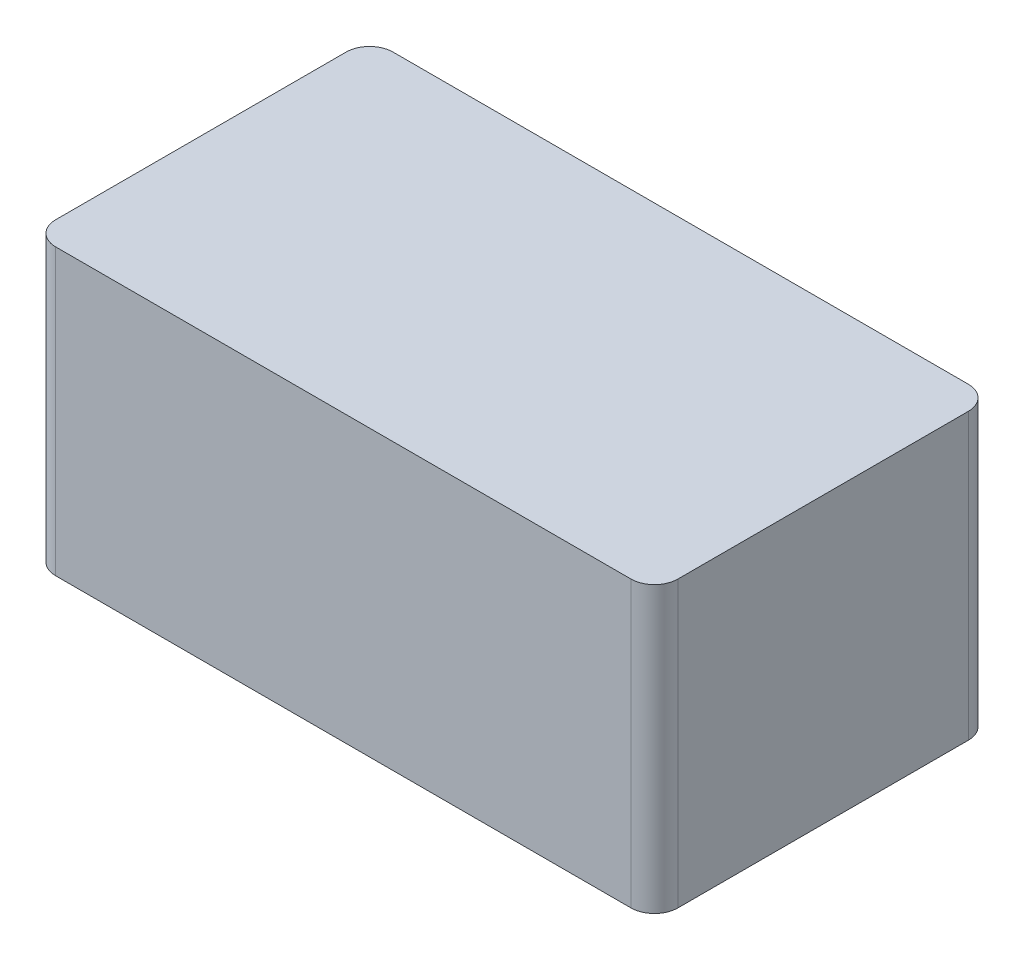
ISO-10303-21;
HEADER;
FILE_DESCRIPTION(('STEP AP214'),'2;1');
FILE_NAME('part.step','',(''),(''),'','','');
FILE_SCHEMA(('AUTOMOTIVE_DESIGN { 1 0 10303 214 1 1 1 1 }'));
ENDSEC;
DATA;
#1=APPLICATION_CONTEXT('core data for automotive mechanical design processes');
#2=APPLICATION_PROTOCOL_DEFINITION('international standard','automotive_design',2000,#1);
#3=PRODUCT_CONTEXT('',#1,'mechanical');
#4=PRODUCT('Part','Part','',(#3));
#5=PRODUCT_RELATED_PRODUCT_CATEGORY('part','',(#4));
#6=PRODUCT_DEFINITION_FORMATION('','',#4);
#7=PRODUCT_DEFINITION_CONTEXT('part definition',#1,'design');
#8=PRODUCT_DEFINITION('design','',#6,#7);
#9=PRODUCT_DEFINITION_SHAPE('','',#8);
#10=(LENGTH_UNIT() NAMED_UNIT(*) SI_UNIT(.MILLI.,.METRE.));
#11=(NAMED_UNIT(*) PLANE_ANGLE_UNIT() SI_UNIT($,.RADIAN.));
#12=(NAMED_UNIT(*) SI_UNIT($,.STERADIAN.) SOLID_ANGLE_UNIT());
#13=UNCERTAINTY_MEASURE_WITH_UNIT(LENGTH_MEASURE(1.E-05),#10,'distance_accuracy_value','');
#14=(GEOMETRIC_REPRESENTATION_CONTEXT(3) GLOBAL_UNCERTAINTY_ASSIGNED_CONTEXT((#13)) GLOBAL_UNIT_ASSIGNED_CONTEXT((#10,
#11,#12)) REPRESENTATION_CONTEXT('',''));
#15=CARTESIAN_POINT('',(0.,0.,0.));
#16=DIRECTION('',(0.,0.,1.));
#17=DIRECTION('',(1.,0.,0.));
#18=AXIS2_PLACEMENT_3D('',#15,#16,#17);
#19=CARTESIAN_POINT('',(-10.4,-5.150000001,-5.25));
#20=DIRECTION('',(0.,1.,0.));
#21=DIRECTION('',(0.,0.,1.));
#22=AXIS2_PLACEMENT_3D('',#19,#20,#21);
#23=CYLINDRICAL_SURFACE('',#22,0.849999999999999);
#24=CARTESIAN_POINT('',(-10.4,-5.150000001,-5.25));
#25=DIRECTION('',(0.,1.,0.));
#26=DIRECTION('',(0.,0.,1.));
#27=AXIS2_PLACEMENT_3D('',#24,#25,#26);
#28=CIRCLE('',#27,0.849999999999999);
#29=CARTESIAN_POINT('',(-10.4,-5.150000001,-6.1));
#30=VERTEX_POINT('',#29);
#31=CARTESIAN_POINT('',(-11.25,-5.1500000005,-5.24999964644661));
#32=VERTEX_POINT('',#31);
#33=EDGE_CURVE('E123',#30,#32,#28,.T.);
#34=ORIENTED_EDGE('',*,*,#33,.T.);
#35=DIRECTION('',(0.,1.,0.));
#36=VECTOR('',#35,1.);
#37=CARTESIAN_POINT('',(-11.25,0.,-5.25));
#38=LINE('',#37,#36);
#39=CARTESIAN_POINT('',(-11.25,5.15,-5.25));
#40=VERTEX_POINT('',#39);
#41=EDGE_CURVE('E130',#32,#40,#38,.T.);
#42=ORIENTED_EDGE('',*,*,#41,.T.);
#43=CARTESIAN_POINT('',(-10.4,5.15,-5.25));
#44=DIRECTION('',(0.,1.,0.));
#45=DIRECTION('',(0.,0.,1.));
#46=AXIS2_PLACEMENT_3D('',#43,#44,#45);
#47=CIRCLE('',#46,0.849999999999999);
#48=CARTESIAN_POINT('',(-10.4,5.15,-6.1));
#49=VERTEX_POINT('',#48);
#50=EDGE_CURVE('E66',#40,#49,#47,.F.);
#51=ORIENTED_EDGE('',*,*,#50,.T.);
#52=DIRECTION('',(0.,1.,0.));
#53=VECTOR('',#52,1.);
#54=CARTESIAN_POINT('',(-10.4,-5.150000001,-6.1));
#55=LINE('',#54,#53);
#56=EDGE_CURVE('E127',#30,#49,#55,.T.);
#57=ORIENTED_EDGE('',*,*,#56,.F.);
#58=EDGE_LOOP('',(#34,#42,#51,#57));
#59=FACE_BOUND('',#58,.T.);
#60=ADVANCED_FACE('F17',(#59),#23,.T.);
#61=CARTESIAN_POINT('',(11.25,0.,0.));
#62=DIRECTION('',(-1.,0.,0.));
#63=DIRECTION('',(0.,0.,1.));
#64=AXIS2_PLACEMENT_3D('',#61,#62,#63);
#65=PLANE('',#64);
#66=DIRECTION('',(0.,-1.,0.));
#67=VECTOR('',#66,1.);
#68=CARTESIAN_POINT('',(11.25,-5.00000214842533E-10,5.25));
#69=LINE('',#68,#67);
#70=CARTESIAN_POINT('',(11.25,5.15,5.25));
#71=VERTEX_POINT('',#70);
#72=CARTESIAN_POINT('',(11.25,-5.1500000005,5.25));
#73=VERTEX_POINT('',#72);
#74=EDGE_CURVE('E126',#71,#73,#69,.T.);
#75=ORIENTED_EDGE('',*,*,#74,.T.);
#76=DIRECTION('',(0.,0.,-1.));
#77=VECTOR('',#76,1.);
#78=CARTESIAN_POINT('',(11.25,-5.15,0.));
#79=LINE('',#78,#77);
#80=CARTESIAN_POINT('',(11.25,-5.1500000005,-5.25));
#81=VERTEX_POINT('',#80);
#82=EDGE_CURVE('E92',#73,#81,#79,.T.);
#83=ORIENTED_EDGE('',*,*,#82,.T.);
#84=DIRECTION('',(0.,1.,0.));
#85=VECTOR('',#84,1.);
#86=CARTESIAN_POINT('',(11.25,0.,-5.25));
#87=LINE('',#86,#85);
#88=CARTESIAN_POINT('',(11.25,5.15,-5.25));
#89=VERTEX_POINT('',#88);
#90=EDGE_CURVE('E85',#89,#81,#87,.F.);
#91=ORIENTED_EDGE('',*,*,#90,.F.);
#92=DIRECTION('',(0.,0.,-1.));
#93=VECTOR('',#92,1.);
#94=CARTESIAN_POINT('',(11.25,5.15,0.));
#95=LINE('',#94,#93);
#96=EDGE_CURVE('E89',#89,#71,#95,.F.);
#97=ORIENTED_EDGE('',*,*,#96,.T.);
#98=EDGE_LOOP('',(#75,#83,#91,#97));
#99=FACE_BOUND('',#98,.T.);
#100=ADVANCED_FACE('F87',(#99),#65,.F.);
#101=CARTESIAN_POINT('',(10.4,-5.150000001,-5.25));
#102=DIRECTION('',(0.,1.,0.));
#103=DIRECTION('',(0.,0.,1.));
#104=AXIS2_PLACEMENT_3D('',#101,#102,#103);
#105=CYLINDRICAL_SURFACE('',#104,0.849999999999998);
#106=DIRECTION('',(0.,1.,0.));
#107=VECTOR('',#106,1.);
#108=CARTESIAN_POINT('',(10.4,0.,-6.1));
#109=LINE('',#108,#107);
#110=CARTESIAN_POINT('',(10.4,-5.15000000025,-6.1));
#111=VERTEX_POINT('',#110);
#112=CARTESIAN_POINT('',(10.4,5.15,-6.1));
#113=VERTEX_POINT('',#112);
#114=EDGE_CURVE('E97',#111,#113,#109,.T.);
#115=ORIENTED_EDGE('',*,*,#114,.T.);
#116=CARTESIAN_POINT('',(10.4,5.15,-5.25));
#117=DIRECTION('',(0.,1.,0.));
#118=DIRECTION('',(0.,0.,1.));
#119=AXIS2_PLACEMENT_3D('',#116,#117,#118);
#120=CIRCLE('',#119,0.849999999999998);
#121=EDGE_CURVE('E96',#89,#113,#120,.T.);
#122=ORIENTED_EDGE('',*,*,#121,.F.);
#123=ORIENTED_EDGE('',*,*,#90,.T.);
#124=CARTESIAN_POINT('',(10.4,-5.1500000005,-5.25));
#125=DIRECTION('',(0.,1.,0.));
#126=DIRECTION('',(0.,0.,1.));
#127=AXIS2_PLACEMENT_3D('',#124,#125,#126);
#128=CIRCLE('',#127,0.849999999999998);
#129=EDGE_CURVE('E121',#81,#111,#128,.T.);
#130=ORIENTED_EDGE('',*,*,#129,.T.);
#131=EDGE_LOOP('',(#115,#122,#123,#130));
#132=FACE_BOUND('',#131,.T.);
#133=ADVANCED_FACE('F100',(#132),#105,.T.);
#134=CARTESIAN_POINT('',(0.,5.15,0.));
#135=DIRECTION('',(0.,-1.,0.));
#136=DIRECTION('',(0.,0.,-1.));
#137=AXIS2_PLACEMENT_3D('',#134,#135,#136);
#138=PLANE('',#137);
#139=DIRECTION('',(-1.,0.,0.));
#140=VECTOR('',#139,1.);
#141=CARTESIAN_POINT('',(0.,5.15,6.1));
#142=LINE('',#141,#140);
#143=CARTESIAN_POINT('',(10.4,5.14999983333333,6.1));
#144=VERTEX_POINT('',#143);
#145=CARTESIAN_POINT('',(-10.4,5.15,6.1));
#146=VERTEX_POINT('',#145);
#147=EDGE_CURVE('E135',#144,#146,#142,.T.);
#148=ORIENTED_EDGE('',*,*,#147,.F.);
#149=CARTESIAN_POINT('',(10.4,5.15,5.25));
#150=DIRECTION('',(0.,1.,0.));
#151=DIRECTION('',(0.,0.,1.));
#152=AXIS2_PLACEMENT_3D('',#149,#150,#151);
#153=CIRCLE('',#152,0.849999999999999);
#154=EDGE_CURVE('E106',#144,#71,#153,.T.);
#155=ORIENTED_EDGE('',*,*,#154,.T.);
#156=ORIENTED_EDGE('',*,*,#96,.F.);
#157=ORIENTED_EDGE('',*,*,#121,.T.);
#158=DIRECTION('',(1.,0.,0.));
#159=VECTOR('',#158,1.);
#160=CARTESIAN_POINT('',(0.,5.15,-6.1));
#161=LINE('',#160,#159);
#162=EDGE_CURVE('E108',#49,#113,#161,.T.);
#163=ORIENTED_EDGE('',*,*,#162,.F.);
#164=ORIENTED_EDGE('',*,*,#50,.F.);
#165=DIRECTION('',(0.,0.,-1.));
#166=VECTOR('',#165,1.);
#167=CARTESIAN_POINT('',(-11.25,5.15,0.));
#168=LINE('',#167,#166);
#169=CARTESIAN_POINT('',(-11.25,5.15,5.25));
#170=VERTEX_POINT('',#169);
#171=EDGE_CURVE('E72',#40,#170,#168,.F.);
#172=ORIENTED_EDGE('',*,*,#171,.T.);
#173=CARTESIAN_POINT('',(-10.4,5.15,5.25));
#174=DIRECTION('',(0.,1.,0.));
#175=DIRECTION('',(0.,0.,1.));
#176=AXIS2_PLACEMENT_3D('',#173,#174,#175);
#177=CIRCLE('',#176,0.849999999999998);
#178=EDGE_CURVE('E102',#146,#170,#177,.F.);
#179=ORIENTED_EDGE('',*,*,#178,.F.);
#180=EDGE_LOOP('',(#148,#155,#156,#157,#163,#164,#172,#179));
#181=FACE_BOUND('',#180,.T.);
#182=ADVANCED_FACE('F105',(#181),#138,.F.);
#183=CARTESIAN_POINT('',(-11.25,0.,0.));
#184=DIRECTION('',(1.,0.,0.));
#185=DIRECTION('',(0.,0.,-1.));
#186=AXIS2_PLACEMENT_3D('',#183,#184,#185);
#187=PLANE('',#186);
#188=DIRECTION('',(0.,1.,0.));
#189=VECTOR('',#188,1.);
#190=CARTESIAN_POINT('',(-11.25,-5.00000214842533E-10,5.25));
#191=LINE('',#190,#189);
#192=CARTESIAN_POINT('',(-11.25,-5.150000001,5.25));
#193=VERTEX_POINT('',#192);
#194=EDGE_CURVE('E110',#193,#170,#191,.T.);
#195=ORIENTED_EDGE('',*,*,#194,.T.);
#196=ORIENTED_EDGE('',*,*,#171,.F.);
#197=ORIENTED_EDGE('',*,*,#41,.F.);
#198=DIRECTION('',(0.,0.,-1.));
#199=VECTOR('',#198,1.);
#200=CARTESIAN_POINT('',(-11.25,-5.15,0.));
#201=LINE('',#200,#199);
#202=EDGE_CURVE('E117',#193,#32,#201,.T.);
#203=ORIENTED_EDGE('',*,*,#202,.F.);
#204=EDGE_LOOP('',(#195,#196,#197,#203));
#205=FACE_BOUND('',#204,.T.);
#206=ADVANCED_FACE('F163',(#205),#187,.F.);
#207=CARTESIAN_POINT('',(-10.4,-5.150000001,5.25));
#208=DIRECTION('',(0.,1.,0.));
#209=DIRECTION('',(0.,0.,1.));
#210=AXIS2_PLACEMENT_3D('',#207,#208,#209);
#211=CYLINDRICAL_SURFACE('',#210,0.849999999999998);
#212=DIRECTION('',(0.,-1.,0.));
#213=VECTOR('',#212,1.);
#214=CARTESIAN_POINT('',(-10.4,-2.50000541102136E-10,6.1));
#215=LINE('',#214,#213);
#216=CARTESIAN_POINT('',(-10.4,-5.14999950075,6.1));
#217=VERTEX_POINT('',#216);
#218=EDGE_CURVE('E138',#146,#217,#215,.T.);
#219=ORIENTED_EDGE('',*,*,#218,.F.);
#220=ORIENTED_EDGE('',*,*,#178,.T.);
#221=ORIENTED_EDGE('',*,*,#194,.F.);
#222=CARTESIAN_POINT('',(-10.4,-5.150000001,5.25));
#223=DIRECTION('',(0.,1.,0.));
#224=DIRECTION('',(0.,0.,1.));
#225=AXIS2_PLACEMENT_3D('',#222,#223,#224);
#226=CIRCLE('',#225,0.849999999999998);
#227=EDGE_CURVE('E35',#193,#217,#226,.T.);
#228=ORIENTED_EDGE('',*,*,#227,.T.);
#229=EDGE_LOOP('',(#219,#220,#221,#228));
#230=FACE_BOUND('',#229,.T.);
#231=ADVANCED_FACE('F159',(#230),#211,.T.);
#232=CARTESIAN_POINT('',(0.,0.,-6.1));
#233=DIRECTION('',(0.,0.,1.));
#234=DIRECTION('',(1.,0.,0.));
#235=AXIS2_PLACEMENT_3D('',#232,#233,#234);
#236=PLANE('',#235);
#237=ORIENTED_EDGE('',*,*,#56,.T.);
#238=ORIENTED_EDGE('',*,*,#162,.T.);
#239=ORIENTED_EDGE('',*,*,#114,.F.);
#240=DIRECTION('',(1.,0.,0.));
#241=VECTOR('',#240,1.);
#242=CARTESIAN_POINT('',(0.,-5.15,-6.1));
#243=LINE('',#242,#241);
#244=EDGE_CURVE('E20',#30,#111,#243,.T.);
#245=ORIENTED_EDGE('',*,*,#244,.F.);
#246=EDGE_LOOP('',(#237,#238,#239,#245));
#247=FACE_BOUND('',#246,.T.);
#248=ADVANCED_FACE('F151',(#247),#236,.F.);
#249=CARTESIAN_POINT('',(10.4,-5.150000001,5.25));
#250=DIRECTION('',(0.,1.,0.));
#251=DIRECTION('',(0.,0.,1.));
#252=AXIS2_PLACEMENT_3D('',#249,#250,#251);
#253=CYLINDRICAL_SURFACE('',#252,0.849999999999999);
#254=ORIENTED_EDGE('',*,*,#74,.F.);
#255=ORIENTED_EDGE('',*,*,#154,.F.);
#256=DIRECTION('',(0.,1.,0.));
#257=VECTOR('',#256,1.);
#258=CARTESIAN_POINT('',(10.4,-2.49999673740398E-10,6.1));
#259=LINE('',#258,#257);
#260=CARTESIAN_POINT('',(10.39999975,-5.150000001,6.1));
#261=VERTEX_POINT('',#260);
#262=EDGE_CURVE('E26',#261,#144,#259,.T.);
#263=ORIENTED_EDGE('',*,*,#262,.F.);
#264=CARTESIAN_POINT('',(10.4,-5.150000001,5.25));
#265=DIRECTION('',(0.,1.,0.));
#266=DIRECTION('',(0.,0.,1.));
#267=AXIS2_PLACEMENT_3D('',#264,#265,#266);
#268=CIRCLE('',#267,0.849999999999999);
#269=EDGE_CURVE('E118',#261,#73,#268,.T.);
#270=ORIENTED_EDGE('',*,*,#269,.T.);
#271=EDGE_LOOP('',(#254,#255,#263,#270));
#272=FACE_BOUND('',#271,.T.);
#273=ADVANCED_FACE('F155',(#272),#253,.T.);
#274=CARTESIAN_POINT('',(0.,-5.15,0.));
#275=DIRECTION('',(0.,-1.,0.));
#276=DIRECTION('',(0.,0.,-1.));
#277=AXIS2_PLACEMENT_3D('',#274,#275,#276);
#278=PLANE('',#277);
#279=ORIENTED_EDGE('',*,*,#33,.F.);
#280=ORIENTED_EDGE('',*,*,#244,.T.);
#281=ORIENTED_EDGE('',*,*,#129,.F.);
#282=ORIENTED_EDGE('',*,*,#82,.F.);
#283=ORIENTED_EDGE('',*,*,#269,.F.);
#284=DIRECTION('',(-1.,0.,0.));
#285=VECTOR('',#284,1.);
#286=CARTESIAN_POINT('',(0.,-5.150000001,6.1));
#287=LINE('',#286,#285);
#288=EDGE_CURVE('E11',#261,#217,#287,.T.);
#289=ORIENTED_EDGE('',*,*,#288,.T.);
#290=ORIENTED_EDGE('',*,*,#227,.F.);
#291=ORIENTED_EDGE('',*,*,#202,.T.);
#292=EDGE_LOOP('',(#279,#280,#281,#282,#283,#289,#290,#291));
#293=FACE_BOUND('',#292,.T.);
#294=ADVANCED_FACE('F145',(#293),#278,.T.);
#295=CARTESIAN_POINT('',(0.,0.,6.1));
#296=DIRECTION('',(0.,0.,-1.));
#297=DIRECTION('',(-1.,0.,0.));
#298=AXIS2_PLACEMENT_3D('',#295,#296,#297);
#299=PLANE('',#298);
#300=ORIENTED_EDGE('',*,*,#218,.T.);
#301=ORIENTED_EDGE('',*,*,#288,.F.);
#302=ORIENTED_EDGE('',*,*,#262,.T.);
#303=ORIENTED_EDGE('',*,*,#147,.T.);
#304=EDGE_LOOP('',(#300,#301,#302,#303));
#305=FACE_BOUND('',#304,.T.);
#306=ADVANCED_FACE('F157',(#305),#299,.F.);
#307=CLOSED_SHELL('',(#60,#100,#133,#182,#206,#231,#248,#273,#294,#306));
#308=MANIFOLD_SOLID_BREP('B1',#307);
#309=ADVANCED_BREP_SHAPE_REPRESENTATION('',(#18,#308),#14);
#310=SHAPE_DEFINITION_REPRESENTATION(#9,#309);
ENDSEC;
END-ISO-10303-21;
